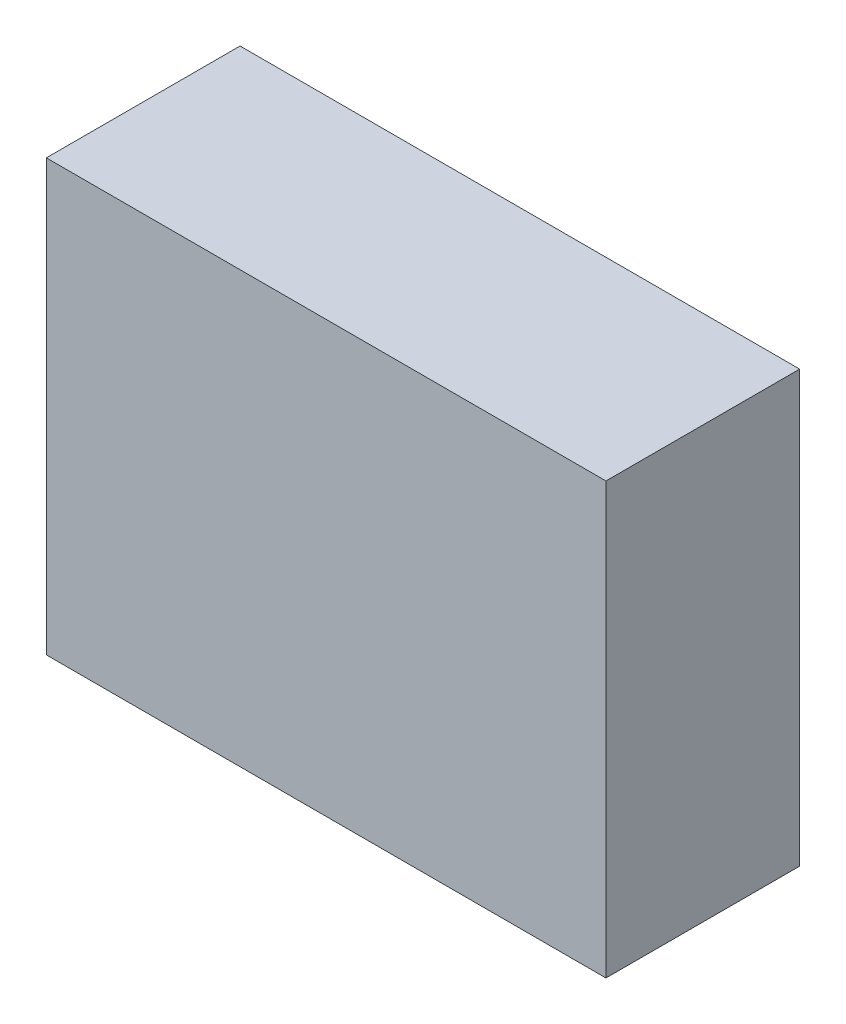
ISO-10303-21;
HEADER;
FILE_DESCRIPTION(('STEP AP214'),'2;1');
FILE_NAME('part.step','',(''),(''),'','','');
FILE_SCHEMA(('AUTOMOTIVE_DESIGN { 1 0 10303 214 1 1 1 1 }'));
ENDSEC;
DATA;
#1=APPLICATION_CONTEXT('core data for automotive mechanical design processes');
#2=APPLICATION_PROTOCOL_DEFINITION('international standard','automotive_design',2000,#1);
#3=PRODUCT_CONTEXT('',#1,'mechanical');
#4=PRODUCT('Part','Part','',(#3));
#5=PRODUCT_RELATED_PRODUCT_CATEGORY('part','',(#4));
#6=PRODUCT_DEFINITION_FORMATION('','',#4);
#7=PRODUCT_DEFINITION_CONTEXT('part definition',#1,'design');
#8=PRODUCT_DEFINITION('design','',#6,#7);
#9=PRODUCT_DEFINITION_SHAPE('','',#8);
#10=(LENGTH_UNIT() NAMED_UNIT(*) SI_UNIT(.MILLI.,.METRE.));
#11=(NAMED_UNIT(*) PLANE_ANGLE_UNIT() SI_UNIT($,.RADIAN.));
#12=(NAMED_UNIT(*) SI_UNIT($,.STERADIAN.) SOLID_ANGLE_UNIT());
#13=UNCERTAINTY_MEASURE_WITH_UNIT(LENGTH_MEASURE(1.E-05),#10,'distance_accuracy_value','');
#14=(GEOMETRIC_REPRESENTATION_CONTEXT(3) GLOBAL_UNCERTAINTY_ASSIGNED_CONTEXT((#13)) GLOBAL_UNIT_ASSIGNED_CONTEXT((#10,
#11,#12)) REPRESENTATION_CONTEXT('',''));
#15=CARTESIAN_POINT('',(0.,0.,0.));
#16=DIRECTION('',(0.,0.,1.));
#17=DIRECTION('',(1.,0.,0.));
#18=AXIS2_PLACEMENT_3D('',#15,#16,#17);
#19=CARTESIAN_POINT('',(-6.4999997,5.00000016,4.49999862));
#20=DIRECTION('',(0.,0.,1.));
#21=DIRECTION('',(1.,0.,0.));
#22=AXIS2_PLACEMENT_3D('',#19,#20,#21);
#23=PLANE('',#22);
#24=DIRECTION('',(0.,1.,0.));
#25=VECTOR('',#24,1.);
#26=CARTESIAN_POINT('',(6.4999997,5.00000016,4.49999862));
#27=LINE('',#26,#25);
#28=CARTESIAN_POINT('',(6.4999997,5.00000016,4.49999862));
#29=VERTEX_POINT('',#28);
#30=CARTESIAN_POINT('',(6.4999997,-5.00000016,4.49999862));
#31=VERTEX_POINT('',#30);
#32=EDGE_CURVE('E53',#29,#31,#27,.F.);
#33=ORIENTED_EDGE('',*,*,#32,.F.);
#34=DIRECTION('',(1.,0.,0.));
#35=VECTOR('',#34,1.);
#36=CARTESIAN_POINT('',(-6.4999997,5.00000016,4.49999862));
#37=LINE('',#36,#35);
#38=CARTESIAN_POINT('',(-6.4999997,5.00000016,4.49999862));
#39=VERTEX_POINT('',#38);
#40=EDGE_CURVE('E68',#39,#29,#37,.T.);
#41=ORIENTED_EDGE('',*,*,#40,.F.);
#42=DIRECTION('',(0.,1.,0.));
#43=VECTOR('',#42,1.);
#44=CARTESIAN_POINT('',(-6.4999997,-5.00000016,4.49999862));
#45=LINE('',#44,#43);
#46=CARTESIAN_POINT('',(-6.4999997,-5.00000016,4.49999862));
#47=VERTEX_POINT('',#46);
#48=EDGE_CURVE('E20',#47,#39,#45,.T.);
#49=ORIENTED_EDGE('',*,*,#48,.F.);
#50=DIRECTION('',(1.,0.,0.));
#51=VECTOR('',#50,1.);
#52=CARTESIAN_POINT('',(6.4999997,-5.00000016,4.49999862));
#53=LINE('',#52,#51);
#54=EDGE_CURVE('E58',#31,#47,#53,.F.);
#55=ORIENTED_EDGE('',*,*,#54,.F.);
#56=EDGE_LOOP('',(#33,#41,#49,#55));
#57=FACE_BOUND('',#56,.T.);
#58=ADVANCED_FACE('F17',(#57),#23,.T.);
#59=CARTESIAN_POINT('',(-6.4999997,-5.00000016,0.));
#60=DIRECTION('',(-1.,0.,0.));
#61=DIRECTION('',(0.,0.,1.));
#62=AXIS2_PLACEMENT_3D('',#59,#60,#61);
#63=PLANE('',#62);
#64=DIRECTION('',(0.,0.,1.));
#65=VECTOR('',#64,1.);
#66=CARTESIAN_POINT('',(-6.4999997,5.00000016,0.));
#67=LINE('',#66,#65);
#68=CARTESIAN_POINT('',(-6.4999997,5.00000016,0.));
#69=VERTEX_POINT('',#68);
#70=EDGE_CURVE('E79',#69,#39,#67,.T.);
#71=ORIENTED_EDGE('',*,*,#70,.F.);
#72=DIRECTION('',(0.,1.,0.));
#73=VECTOR('',#72,1.);
#74=CARTESIAN_POINT('',(-6.4999997,5.00000016,0.));
#75=LINE('',#74,#73);
#76=CARTESIAN_POINT('',(-6.4999997,-5.00000016,0.));
#77=VERTEX_POINT('',#76);
#78=EDGE_CURVE('E74',#69,#77,#75,.F.);
#79=ORIENTED_EDGE('',*,*,#78,.T.);
#80=DIRECTION('',(0.,0.,-1.));
#81=VECTOR('',#80,1.);
#82=CARTESIAN_POINT('',(-6.4999997,-5.00000016,0.));
#83=LINE('',#82,#81);
#84=EDGE_CURVE('E63',#47,#77,#83,.T.);
#85=ORIENTED_EDGE('',*,*,#84,.F.);
#86=ORIENTED_EDGE('',*,*,#48,.T.);
#87=EDGE_LOOP('',(#71,#79,#85,#86));
#88=FACE_BOUND('',#87,.T.);
#89=ADVANCED_FACE('F73',(#88),#63,.T.);
#90=CARTESIAN_POINT('',(6.4999997,-5.00000016,0.));
#91=DIRECTION('',(0.,-1.,0.));
#92=DIRECTION('',(0.,0.,-1.));
#93=AXIS2_PLACEMENT_3D('',#90,#91,#92);
#94=PLANE('',#93);
#95=ORIENTED_EDGE('',*,*,#84,.T.);
#96=DIRECTION('',(1.,0.,0.));
#97=VECTOR('',#96,1.);
#98=CARTESIAN_POINT('',(-6.4999997,-5.00000016,0.));
#99=LINE('',#98,#97);
#100=CARTESIAN_POINT('',(6.4999997,-5.00000016,0.));
#101=VERTEX_POINT('',#100);
#102=EDGE_CURVE('E84',#77,#101,#99,.T.);
#103=ORIENTED_EDGE('',*,*,#102,.T.);
#104=DIRECTION('',(0.,0.,-1.));
#105=VECTOR('',#104,1.);
#106=CARTESIAN_POINT('',(6.4999997,-5.00000016,0.));
#107=LINE('',#106,#105);
#108=EDGE_CURVE('E65',#31,#101,#107,.T.);
#109=ORIENTED_EDGE('',*,*,#108,.F.);
#110=ORIENTED_EDGE('',*,*,#54,.T.);
#111=EDGE_LOOP('',(#95,#103,#109,#110));
#112=FACE_BOUND('',#111,.T.);
#113=ADVANCED_FACE('F60',(#112),#94,.T.);
#114=CARTESIAN_POINT('',(6.4999997,5.00000016,0.));
#115=DIRECTION('',(1.,0.,0.));
#116=DIRECTION('',(0.,0.,-1.));
#117=AXIS2_PLACEMENT_3D('',#114,#115,#116);
#118=PLANE('',#117);
#119=ORIENTED_EDGE('',*,*,#108,.T.);
#120=DIRECTION('',(0.,1.,0.));
#121=VECTOR('',#120,1.);
#122=CARTESIAN_POINT('',(6.4999997,5.00000016,0.));
#123=LINE('',#122,#121);
#124=CARTESIAN_POINT('',(6.4999997,5.00000016,0.));
#125=VERTEX_POINT('',#124);
#126=EDGE_CURVE('E26',#101,#125,#123,.T.);
#127=ORIENTED_EDGE('',*,*,#126,.T.);
#128=DIRECTION('',(0.,0.,1.));
#129=VECTOR('',#128,1.);
#130=CARTESIAN_POINT('',(6.4999997,5.00000016,0.));
#131=LINE('',#130,#129);
#132=EDGE_CURVE('E34',#29,#125,#131,.F.);
#133=ORIENTED_EDGE('',*,*,#132,.F.);
#134=ORIENTED_EDGE('',*,*,#32,.T.);
#135=EDGE_LOOP('',(#119,#127,#133,#134));
#136=FACE_BOUND('',#135,.T.);
#137=ADVANCED_FACE('F88',(#136),#118,.T.);
#138=CARTESIAN_POINT('',(-6.4999997,5.00000016,0.));
#139=DIRECTION('',(0.,1.,0.));
#140=DIRECTION('',(0.,0.,1.));
#141=AXIS2_PLACEMENT_3D('',#138,#139,#140);
#142=PLANE('',#141);
#143=ORIENTED_EDGE('',*,*,#132,.T.);
#144=DIRECTION('',(1.,0.,0.));
#145=VECTOR('',#144,1.);
#146=CARTESIAN_POINT('',(-6.4999997,5.00000016,0.));
#147=LINE('',#146,#145);
#148=EDGE_CURVE('E11',#125,#69,#147,.F.);
#149=ORIENTED_EDGE('',*,*,#148,.T.);
#150=ORIENTED_EDGE('',*,*,#70,.T.);
#151=ORIENTED_EDGE('',*,*,#40,.T.);
#152=EDGE_LOOP('',(#143,#149,#150,#151));
#153=FACE_BOUND('',#152,.T.);
#154=ADVANCED_FACE('F91',(#153),#142,.T.);
#155=CARTESIAN_POINT('',(-6.4999997,5.00000016,0.));
#156=DIRECTION('',(0.,0.,1.));
#157=DIRECTION('',(1.,0.,0.));
#158=AXIS2_PLACEMENT_3D('',#155,#156,#157);
#159=PLANE('',#158);
#160=ORIENTED_EDGE('',*,*,#126,.F.);
#161=ORIENTED_EDGE('',*,*,#102,.F.);
#162=ORIENTED_EDGE('',*,*,#78,.F.);
#163=ORIENTED_EDGE('',*,*,#148,.F.);
#164=EDGE_LOOP('',(#160,#161,#162,#163));
#165=FACE_BOUND('',#164,.T.);
#166=ADVANCED_FACE('F90',(#165),#159,.F.);
#167=CLOSED_SHELL('',(#58,#89,#113,#137,#154,#166));
#168=MANIFOLD_SOLID_BREP('B1',#167);
#169=ADVANCED_BREP_SHAPE_REPRESENTATION('',(#18,#168),#14);
#170=SHAPE_DEFINITION_REPRESENTATION(#9,#169);
ENDSEC;
END-ISO-10303-21;
